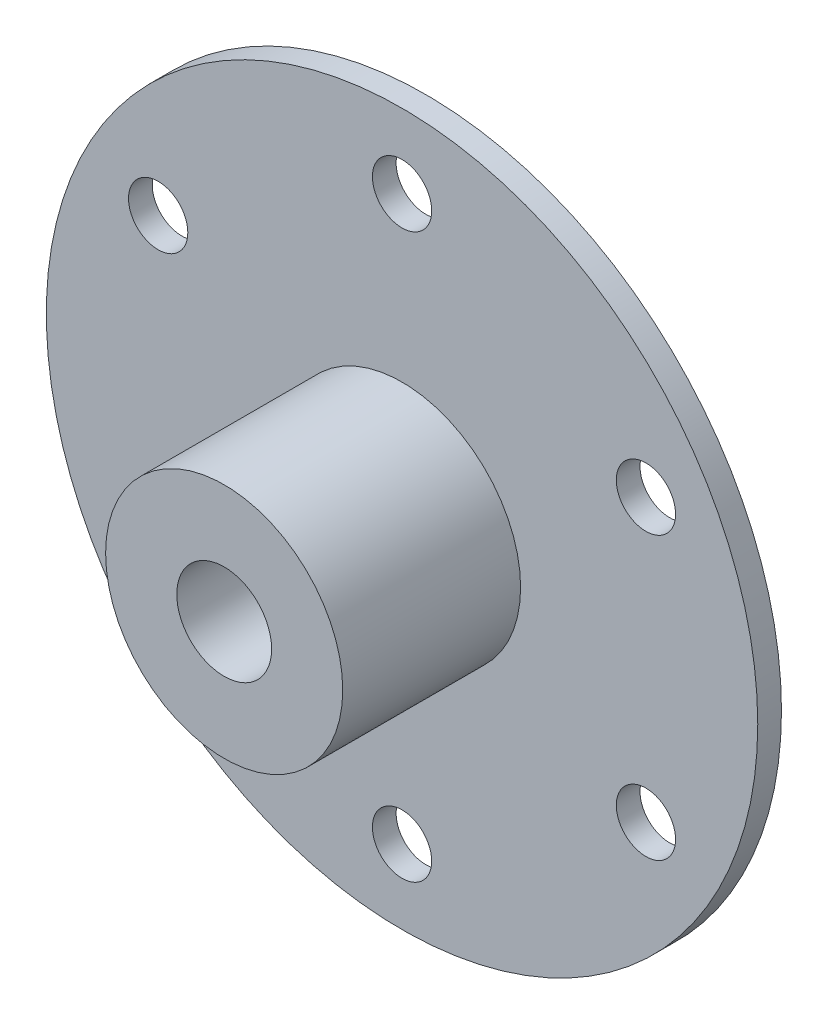
ISO-10303-21;
HEADER;
FILE_DESCRIPTION(('STEP AP214'),'2;1');
FILE_NAME('part.step','',(''),(''),'','','');
FILE_SCHEMA(('AUTOMOTIVE_DESIGN { 1 0 10303 214 1 1 1 1 }'));
ENDSEC;
DATA;
#1=APPLICATION_CONTEXT('core data for automotive mechanical design processes');
#2=APPLICATION_PROTOCOL_DEFINITION('international standard','automotive_design',2000,#1);
#3=PRODUCT_CONTEXT('',#1,'mechanical');
#4=PRODUCT('Part','Part','',(#3));
#5=PRODUCT_RELATED_PRODUCT_CATEGORY('part','',(#4));
#6=PRODUCT_DEFINITION_FORMATION('','',#4);
#7=PRODUCT_DEFINITION_CONTEXT('part definition',#1,'design');
#8=PRODUCT_DEFINITION('design','',#6,#7);
#9=PRODUCT_DEFINITION_SHAPE('','',#8);
#10=(LENGTH_UNIT() NAMED_UNIT(*) SI_UNIT(.MILLI.,.METRE.));
#11=(NAMED_UNIT(*) PLANE_ANGLE_UNIT() SI_UNIT($,.RADIAN.));
#12=(NAMED_UNIT(*) SI_UNIT($,.STERADIAN.) SOLID_ANGLE_UNIT());
#13=UNCERTAINTY_MEASURE_WITH_UNIT(LENGTH_MEASURE(1.E-05),#10,'distance_accuracy_value','');
#14=(GEOMETRIC_REPRESENTATION_CONTEXT(3) GLOBAL_UNCERTAINTY_ASSIGNED_CONTEXT((#13)) GLOBAL_UNIT_ASSIGNED_CONTEXT((#10,
#11,#12)) REPRESENTATION_CONTEXT('',''));
#15=CARTESIAN_POINT('',(0.,0.,0.));
#16=DIRECTION('',(0.,0.,1.));
#17=DIRECTION('',(1.,0.,0.));
#18=AXIS2_PLACEMENT_3D('',#15,#16,#17);
#19=CARTESIAN_POINT('',(0.,0.,2.));
#20=DIRECTION('',(0.,0.,1.));
#21=DIRECTION('',(1.,0.,0.));
#22=AXIS2_PLACEMENT_3D('',#19,#20,#21);
#23=PLANE('',#22);
#24=CARTESIAN_POINT('',(0.,0.,2.));
#25=DIRECTION('',(0.,0.,1.));
#26=DIRECTION('',(1.,0.,0.));
#27=AXIS2_PLACEMENT_3D('',#24,#25,#26);
#28=CIRCLE('',#27,10.);
#29=CARTESIAN_POINT('',(10.,0.,2.));
#30=VERTEX_POINT('',#29);
#31=EDGE_CURVE('E84',#30,#30,#28,.T.);
#32=ORIENTED_EDGE('',*,*,#31,.F.);
#33=EDGE_LOOP('',(#32));
#34=FACE_BOUND('',#33,.T.);
#35=CARTESIAN_POINT('',(-20.5681033398795,-11.874999999999,2.));
#36=DIRECTION('',(0.,0.,1.));
#37=DIRECTION('',(1.,0.,0.));
#38=AXIS2_PLACEMENT_3D('',#35,#36,#37);
#39=CIRCLE('',#38,2.50000000000015);
#40=CARTESIAN_POINT('',(-18.0681033398794,-11.874999999999,2.));
#41=VERTEX_POINT('',#40);
#42=EDGE_CURVE('E69',#41,#41,#39,.T.);
#43=ORIENTED_EDGE('',*,*,#42,.F.);
#44=EDGE_LOOP('',(#43));
#45=FACE_BOUND('',#44,.T.);
#46=CARTESIAN_POINT('',(20.56810333988,-11.8749999999987,2.));
#47=DIRECTION('',(0.,0.,1.));
#48=DIRECTION('',(1.,0.,0.));
#49=AXIS2_PLACEMENT_3D('',#46,#47,#48);
#50=CIRCLE('',#49,2.50000000000127);
#51=CARTESIAN_POINT('',(23.0681033398812,-11.8749999999987,2.));
#52=VERTEX_POINT('',#51);
#53=EDGE_CURVE('E57',#52,#52,#50,.T.);
#54=ORIENTED_EDGE('',*,*,#53,.F.);
#55=EDGE_LOOP('',(#54));
#56=FACE_BOUND('',#55,.T.);
#57=CARTESIAN_POINT('',(0.,23.75,2.));
#58=DIRECTION('',(0.,0.,1.));
#59=DIRECTION('',(1.,0.,0.));
#60=AXIS2_PLACEMENT_3D('',#57,#58,#59);
#61=CIRCLE('',#60,2.5);
#62=CARTESIAN_POINT('',(2.5,23.75,2.));
#63=VERTEX_POINT('',#62);
#64=EDGE_CURVE('E46',#63,#63,#61,.T.);
#65=ORIENTED_EDGE('',*,*,#64,.F.);
#66=EDGE_LOOP('',(#65));
#67=FACE_BOUND('',#66,.T.);
#68=CARTESIAN_POINT('',(0.,0.,2.));
#69=DIRECTION('',(0.,0.,1.));
#70=DIRECTION('',(1.,0.,0.));
#71=AXIS2_PLACEMENT_3D('',#68,#69,#70);
#72=CIRCLE('',#71,30.);
#73=CARTESIAN_POINT('',(30.,0.,2.));
#74=VERTEX_POINT('',#73);
#75=EDGE_CURVE('E37',#74,#74,#72,.T.);
#76=ORIENTED_EDGE('',*,*,#75,.T.);
#77=EDGE_LOOP('',(#76));
#78=FACE_BOUND('',#77,.T.);
#79=CARTESIAN_POINT('',(20.5681033398798,11.8750000000005,2.));
#80=DIRECTION('',(0.,0.,1.));
#81=DIRECTION('',(1.,0.,0.));
#82=AXIS2_PLACEMENT_3D('',#79,#80,#81);
#83=CIRCLE('',#82,2.50000000000085);
#84=CARTESIAN_POINT('',(23.0681033398807,11.8750000000005,2.));
#85=VERTEX_POINT('',#84);
#86=EDGE_CURVE('E51',#85,#85,#83,.T.);
#87=ORIENTED_EDGE('',*,*,#86,.F.);
#88=EDGE_LOOP('',(#87));
#89=FACE_BOUND('',#88,.T.);
#90=CARTESIAN_POINT('',(2.98227860698257E-13,-23.7499999999984,2.));
#91=DIRECTION('',(0.,0.,1.));
#92=DIRECTION('',(1.,0.,0.));
#93=AXIS2_PLACEMENT_3D('',#90,#91,#92);
#94=CIRCLE('',#93,2.5000000000009);
#95=CARTESIAN_POINT('',(2.5000000000012,-23.7499999999984,2.));
#96=VERTEX_POINT('',#95);
#97=EDGE_CURVE('E63',#96,#96,#94,.T.);
#98=ORIENTED_EDGE('',*,*,#97,.F.);
#99=EDGE_LOOP('',(#98));
#100=FACE_BOUND('',#99,.T.);
#101=CARTESIAN_POINT('',(-20.5681033398797,11.8750000000002,2.));
#102=DIRECTION('',(0.,0.,1.));
#103=DIRECTION('',(1.,0.,0.));
#104=AXIS2_PLACEMENT_3D('',#101,#102,#103);
#105=CIRCLE('',#104,2.49999999999986);
#106=CARTESIAN_POINT('',(-18.0681033398798,11.8750000000002,2.));
#107=VERTEX_POINT('',#106);
#108=EDGE_CURVE('E75',#107,#107,#105,.T.);
#109=ORIENTED_EDGE('',*,*,#108,.F.);
#110=EDGE_LOOP('',(#109));
#111=FACE_BOUND('',#110,.T.);
#112=ADVANCED_FACE('F30',(#34,#45,#56,#67,#78,#89,#100,#111),#23,.T.);
#113=CARTESIAN_POINT('',(0.,0.,0.));
#114=DIRECTION('',(0.,0.,1.));
#115=DIRECTION('',(1.,0.,0.));
#116=AXIS2_PLACEMENT_3D('',#113,#114,#115);
#117=PLANE('',#116);
#118=CARTESIAN_POINT('',(0.,0.,0.));
#119=DIRECTION('',(0.,0.,1.));
#120=DIRECTION('',(1.,0.,0.));
#121=AXIS2_PLACEMENT_3D('',#118,#119,#120);
#122=CIRCLE('',#121,30.);
#123=CARTESIAN_POINT('',(30.,0.,0.));
#124=VERTEX_POINT('',#123);
#125=EDGE_CURVE('E41',#124,#124,#122,.T.);
#126=ORIENTED_EDGE('',*,*,#125,.F.);
#127=EDGE_LOOP('',(#126));
#128=FACE_BOUND('',#127,.T.);
#129=CARTESIAN_POINT('',(0.,23.75,0.));
#130=DIRECTION('',(0.,0.,1.));
#131=DIRECTION('',(1.,0.,0.));
#132=AXIS2_PLACEMENT_3D('',#129,#130,#131);
#133=CIRCLE('',#132,2.5);
#134=CARTESIAN_POINT('',(2.5,23.75,0.));
#135=VERTEX_POINT('',#134);
#136=EDGE_CURVE('E48',#135,#135,#133,.T.);
#137=ORIENTED_EDGE('',*,*,#136,.T.);
#138=EDGE_LOOP('',(#137));
#139=FACE_BOUND('',#138,.T.);
#140=CARTESIAN_POINT('',(20.5681033398798,11.8750000000005,0.));
#141=DIRECTION('',(0.,0.,1.));
#142=DIRECTION('',(1.,0.,0.));
#143=AXIS2_PLACEMENT_3D('',#140,#141,#142);
#144=CIRCLE('',#143,2.50000000000085);
#145=CARTESIAN_POINT('',(23.0681033398807,11.8750000000005,0.));
#146=VERTEX_POINT('',#145);
#147=EDGE_CURVE('E54',#146,#146,#144,.T.);
#148=ORIENTED_EDGE('',*,*,#147,.T.);
#149=EDGE_LOOP('',(#148));
#150=FACE_BOUND('',#149,.T.);
#151=CARTESIAN_POINT('',(20.56810333988,-11.8749999999987,0.));
#152=DIRECTION('',(0.,0.,1.));
#153=DIRECTION('',(1.,0.,0.));
#154=AXIS2_PLACEMENT_3D('',#151,#152,#153);
#155=CIRCLE('',#154,2.50000000000127);
#156=CARTESIAN_POINT('',(23.0681033398812,-11.8749999999987,0.));
#157=VERTEX_POINT('',#156);
#158=EDGE_CURVE('E60',#157,#157,#155,.T.);
#159=ORIENTED_EDGE('',*,*,#158,.T.);
#160=EDGE_LOOP('',(#159));
#161=FACE_BOUND('',#160,.T.);
#162=CARTESIAN_POINT('',(2.98227860698257E-13,-23.7499999999984,0.));
#163=DIRECTION('',(0.,0.,1.));
#164=DIRECTION('',(1.,0.,0.));
#165=AXIS2_PLACEMENT_3D('',#162,#163,#164);
#166=CIRCLE('',#165,2.5000000000009);
#167=CARTESIAN_POINT('',(2.5000000000012,-23.7499999999984,0.));
#168=VERTEX_POINT('',#167);
#169=EDGE_CURVE('E66',#168,#168,#166,.T.);
#170=ORIENTED_EDGE('',*,*,#169,.T.);
#171=EDGE_LOOP('',(#170));
#172=FACE_BOUND('',#171,.T.);
#173=CARTESIAN_POINT('',(-20.5681033398795,-11.874999999999,0.));
#174=DIRECTION('',(0.,0.,1.));
#175=DIRECTION('',(1.,0.,0.));
#176=AXIS2_PLACEMENT_3D('',#173,#174,#175);
#177=CIRCLE('',#176,2.50000000000015);
#178=CARTESIAN_POINT('',(-18.0681033398794,-11.874999999999,0.));
#179=VERTEX_POINT('',#178);
#180=EDGE_CURVE('E72',#179,#179,#177,.T.);
#181=ORIENTED_EDGE('',*,*,#180,.T.);
#182=EDGE_LOOP('',(#181));
#183=FACE_BOUND('',#182,.T.);
#184=CARTESIAN_POINT('',(-20.5681033398797,11.8750000000002,0.));
#185=DIRECTION('',(0.,0.,1.));
#186=DIRECTION('',(1.,0.,0.));
#187=AXIS2_PLACEMENT_3D('',#184,#185,#186);
#188=CIRCLE('',#187,2.49999999999986);
#189=CARTESIAN_POINT('',(-18.0681033398798,11.8750000000002,0.));
#190=VERTEX_POINT('',#189);
#191=EDGE_CURVE('E78',#190,#190,#188,.T.);
#192=ORIENTED_EDGE('',*,*,#191,.T.);
#193=EDGE_LOOP('',(#192));
#194=FACE_BOUND('',#193,.T.);
#195=ADVANCED_FACE('F112',(#128,#139,#150,#161,#172,#183,#194),#117,.F.);
#196=CARTESIAN_POINT('',(0.,0.,2.));
#197=DIRECTION('',(0.,0.,-1.));
#198=DIRECTION('',(-1.,0.,0.));
#199=AXIS2_PLACEMENT_3D('',#196,#197,#198);
#200=CYLINDRICAL_SURFACE('',#199,30.);
#201=ORIENTED_EDGE('',*,*,#75,.F.);
#202=EDGE_LOOP('',(#201));
#203=FACE_BOUND('',#202,.T.);
#204=ORIENTED_EDGE('',*,*,#125,.T.);
#205=EDGE_LOOP('',(#204));
#206=FACE_BOUND('',#205,.T.);
#207=ADVANCED_FACE('F32',(#203,#206),#200,.T.);
#208=CARTESIAN_POINT('',(0.,23.75,2.));
#209=DIRECTION('',(0.,0.,-1.));
#210=DIRECTION('',(-1.,0.,0.));
#211=AXIS2_PLACEMENT_3D('',#208,#209,#210);
#212=CYLINDRICAL_SURFACE('',#211,2.5);
#213=ORIENTED_EDGE('',*,*,#64,.T.);
#214=EDGE_LOOP('',(#213));
#215=FACE_BOUND('',#214,.T.);
#216=ORIENTED_EDGE('',*,*,#136,.F.);
#217=EDGE_LOOP('',(#216));
#218=FACE_BOUND('',#217,.T.);
#219=ADVANCED_FACE('F189',(#215,#218),#212,.F.);
#220=CARTESIAN_POINT('',(20.5681033398798,11.8750000000005,2.));
#221=DIRECTION('',(0.,0.,-1.));
#222=DIRECTION('',(-1.,0.,0.));
#223=AXIS2_PLACEMENT_3D('',#220,#221,#222);
#224=CYLINDRICAL_SURFACE('',#223,2.50000000000085);
#225=ORIENTED_EDGE('',*,*,#86,.T.);
#226=EDGE_LOOP('',(#225));
#227=FACE_BOUND('',#226,.T.);
#228=ORIENTED_EDGE('',*,*,#147,.F.);
#229=EDGE_LOOP('',(#228));
#230=FACE_BOUND('',#229,.T.);
#231=ADVANCED_FACE('F179',(#227,#230),#224,.F.);
#232=CARTESIAN_POINT('',(20.56810333988,-11.8749999999987,2.));
#233=DIRECTION('',(0.,0.,-1.));
#234=DIRECTION('',(-1.,0.,0.));
#235=AXIS2_PLACEMENT_3D('',#232,#233,#234);
#236=CYLINDRICAL_SURFACE('',#235,2.50000000000127);
#237=ORIENTED_EDGE('',*,*,#53,.T.);
#238=EDGE_LOOP('',(#237));
#239=FACE_BOUND('',#238,.T.);
#240=ORIENTED_EDGE('',*,*,#158,.F.);
#241=EDGE_LOOP('',(#240));
#242=FACE_BOUND('',#241,.T.);
#243=ADVANCED_FACE('F169',(#239,#242),#236,.F.);
#244=CARTESIAN_POINT('',(2.98227860698257E-13,-23.7499999999984,2.));
#245=DIRECTION('',(0.,0.,-1.));
#246=DIRECTION('',(-1.,0.,0.));
#247=AXIS2_PLACEMENT_3D('',#244,#245,#246);
#248=CYLINDRICAL_SURFACE('',#247,2.5000000000009);
#249=ORIENTED_EDGE('',*,*,#97,.T.);
#250=EDGE_LOOP('',(#249));
#251=FACE_BOUND('',#250,.T.);
#252=ORIENTED_EDGE('',*,*,#169,.F.);
#253=EDGE_LOOP('',(#252));
#254=FACE_BOUND('',#253,.T.);
#255=ADVANCED_FACE('F159',(#251,#254),#248,.F.);
#256=CARTESIAN_POINT('',(-20.5681033398795,-11.874999999999,2.));
#257=DIRECTION('',(0.,0.,-1.));
#258=DIRECTION('',(-1.,0.,0.));
#259=AXIS2_PLACEMENT_3D('',#256,#257,#258);
#260=CYLINDRICAL_SURFACE('',#259,2.50000000000015);
#261=ORIENTED_EDGE('',*,*,#42,.T.);
#262=EDGE_LOOP('',(#261));
#263=FACE_BOUND('',#262,.T.);
#264=ORIENTED_EDGE('',*,*,#180,.F.);
#265=EDGE_LOOP('',(#264));
#266=FACE_BOUND('',#265,.T.);
#267=ADVANCED_FACE('F107',(#263,#266),#260,.F.);
#268=CARTESIAN_POINT('',(-20.5681033398797,11.8750000000002,2.));
#269=DIRECTION('',(0.,0.,-1.));
#270=DIRECTION('',(-1.,0.,0.));
#271=AXIS2_PLACEMENT_3D('',#268,#269,#270);
#272=CYLINDRICAL_SURFACE('',#271,2.49999999999986);
#273=ORIENTED_EDGE('',*,*,#108,.T.);
#274=EDGE_LOOP('',(#273));
#275=FACE_BOUND('',#274,.T.);
#276=ORIENTED_EDGE('',*,*,#191,.F.);
#277=EDGE_LOOP('',(#276));
#278=FACE_BOUND('',#277,.T.);
#279=ADVANCED_FACE('F98',(#275,#278),#272,.F.);
#280=CARTESIAN_POINT('',(0.,0.,17.));
#281=DIRECTION('',(0.,0.,1.));
#282=DIRECTION('',(1.,0.,0.));
#283=AXIS2_PLACEMENT_3D('',#280,#281,#282);
#284=PLANE('',#283);
#285=CARTESIAN_POINT('',(0.,0.,17.));
#286=DIRECTION('',(0.,0.,1.));
#287=DIRECTION('',(1.,0.,0.));
#288=AXIS2_PLACEMENT_3D('',#285,#286,#287);
#289=CIRCLE('',#288,10.);
#290=CARTESIAN_POINT('',(10.,0.,17.));
#291=VERTEX_POINT('',#290);
#292=EDGE_CURVE('E81',#291,#291,#289,.T.);
#293=ORIENTED_EDGE('',*,*,#292,.T.);
#294=EDGE_LOOP('',(#293));
#295=FACE_BOUND('',#294,.T.);
#296=CARTESIAN_POINT('',(0.,0.,17.));
#297=DIRECTION('',(0.,0.,1.));
#298=DIRECTION('',(1.,0.,0.));
#299=AXIS2_PLACEMENT_3D('',#296,#297,#298);
#300=CIRCLE('',#299,4.);
#301=CARTESIAN_POINT('',(4.,0.,17.));
#302=VERTEX_POINT('',#301);
#303=EDGE_CURVE('E87',#302,#302,#300,.T.);
#304=ORIENTED_EDGE('',*,*,#303,.F.);
#305=EDGE_LOOP('',(#304));
#306=FACE_BOUND('',#305,.T.);
#307=ADVANCED_FACE('F95',(#295,#306),#284,.T.);
#308=CARTESIAN_POINT('',(0.,0.,17.));
#309=DIRECTION('',(0.,0.,-1.));
#310=DIRECTION('',(-1.,0.,0.));
#311=AXIS2_PLACEMENT_3D('',#308,#309,#310);
#312=CYLINDRICAL_SURFACE('',#311,10.);
#313=ORIENTED_EDGE('',*,*,#292,.F.);
#314=EDGE_LOOP('',(#313));
#315=FACE_BOUND('',#314,.T.);
#316=ORIENTED_EDGE('',*,*,#31,.T.);
#317=EDGE_LOOP('',(#316));
#318=FACE_BOUND('',#317,.T.);
#319=ADVANCED_FACE('F97',(#315,#318),#312,.T.);
#320=CARTESIAN_POINT('',(0.,0.,17.));
#321=DIRECTION('',(0.,0.,-1.));
#322=DIRECTION('',(-1.,0.,0.));
#323=AXIS2_PLACEMENT_3D('',#320,#321,#322);
#324=CYLINDRICAL_SURFACE('',#323,4.);
#325=ORIENTED_EDGE('',*,*,#303,.T.);
#326=EDGE_LOOP('',(#325));
#327=FACE_BOUND('',#326,.T.);
#328=CARTESIAN_POINT('',(0.,0.,2.));
#329=DIRECTION('',(0.,0.,1.));
#330=DIRECTION('',(1.,0.,0.));
#331=AXIS2_PLACEMENT_3D('',#328,#329,#330);
#332=CIRCLE('',#331,4.);
#333=CARTESIAN_POINT('',(4.,0.,2.));
#334=VERTEX_POINT('',#333);
#335=EDGE_CURVE('E10',#334,#334,#332,.F.);
#336=ORIENTED_EDGE('',*,*,#335,.T.);
#337=EDGE_LOOP('',(#336));
#338=FACE_BOUND('',#337,.T.);
#339=ADVANCED_FACE('F93',(#327,#338),#324,.F.);
#340=ORIENTED_EDGE('',*,*,#335,.F.);
#341=EDGE_LOOP('',(#340));
#342=FACE_BOUND('',#341,.T.);
#343=ADVANCED_FACE('F115',(#342),#23,.T.);
#344=CLOSED_SHELL('',(#112,#195,#207,#219,#231,#243,#255,#267,#279,#307,#319,#339,#343));
#345=MANIFOLD_SOLID_BREP('B2',#344);
#346=ADVANCED_BREP_SHAPE_REPRESENTATION('',(#18,#345),#14);
#347=SHAPE_DEFINITION_REPRESENTATION(#9,#346);
ENDSEC;
END-ISO-10303-21;
